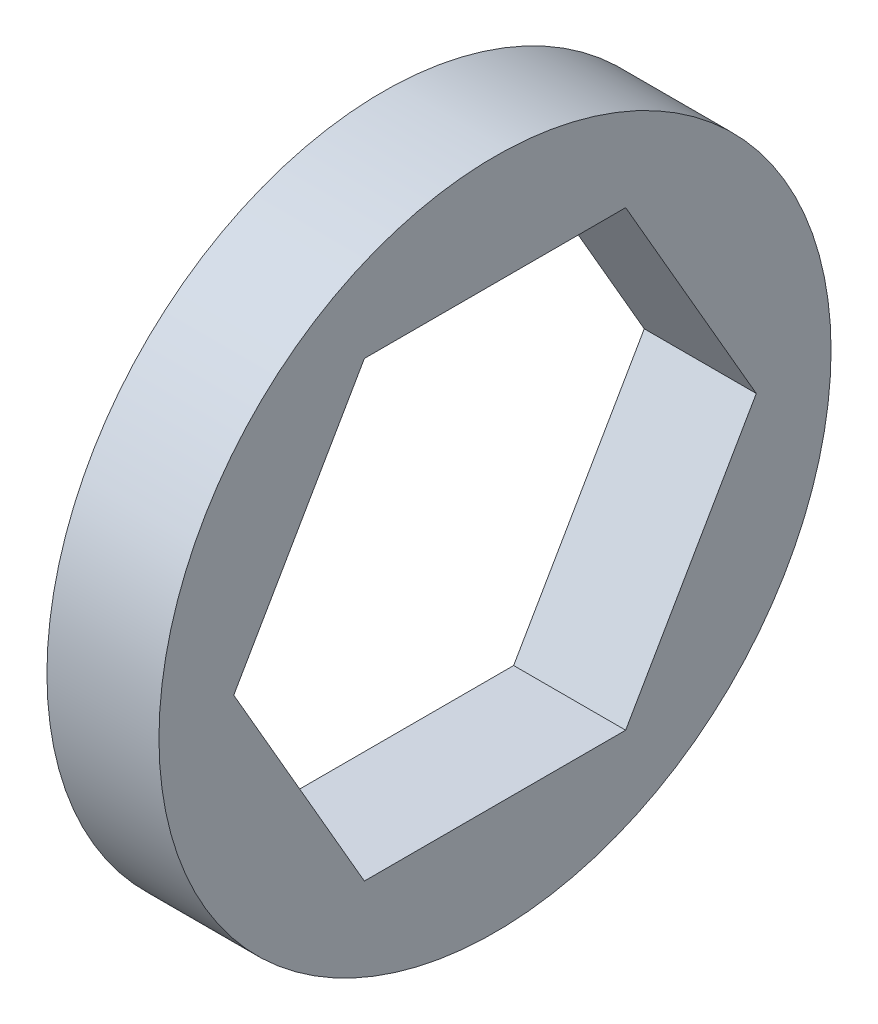
ISO-10303-21;
HEADER;
FILE_DESCRIPTION(('STEP AP214'),'2;1');
FILE_NAME('part.step','',(''),(''),'','','');
FILE_SCHEMA(('AUTOMOTIVE_DESIGN { 1 0 10303 214 1 1 1 1 }'));
ENDSEC;
DATA;
#1=APPLICATION_CONTEXT('core data for automotive mechanical design processes');
#2=APPLICATION_PROTOCOL_DEFINITION('international standard','automotive_design',2000,#1);
#3=PRODUCT_CONTEXT('',#1,'mechanical');
#4=PRODUCT('Part','Part','',(#3));
#5=PRODUCT_RELATED_PRODUCT_CATEGORY('part','',(#4));
#6=PRODUCT_DEFINITION_FORMATION('','',#4);
#7=PRODUCT_DEFINITION_CONTEXT('part definition',#1,'design');
#8=PRODUCT_DEFINITION('design','',#6,#7);
#9=PRODUCT_DEFINITION_SHAPE('','',#8);
#10=(LENGTH_UNIT() NAMED_UNIT(*) SI_UNIT(.MILLI.,.METRE.));
#11=(NAMED_UNIT(*) PLANE_ANGLE_UNIT() SI_UNIT($,.RADIAN.));
#12=(NAMED_UNIT(*) SI_UNIT($,.STERADIAN.) SOLID_ANGLE_UNIT());
#13=UNCERTAINTY_MEASURE_WITH_UNIT(LENGTH_MEASURE(1.E-05),#10,'distance_accuracy_value','');
#14=(GEOMETRIC_REPRESENTATION_CONTEXT(3) GLOBAL_UNCERTAINTY_ASSIGNED_CONTEXT((#13)) GLOBAL_UNIT_ASSIGNED_CONTEXT((#10,
#11,#12)) REPRESENTATION_CONTEXT('',''));
#15=CARTESIAN_POINT('',(0.,0.,0.));
#16=DIRECTION('',(0.,0.,1.));
#17=DIRECTION('',(1.,0.,0.));
#18=AXIS2_PLACEMENT_3D('',#15,#16,#17);
#19=CARTESIAN_POINT('',(3.175,0.,0.));
#20=DIRECTION('',(1.,0.,0.));
#21=DIRECTION('',(0.,0.,-1.));
#22=AXIS2_PLACEMENT_3D('',#19,#20,#21);
#23=PLANE('',#22);
#24=CARTESIAN_POINT('',(3.175,0.,0.));
#25=DIRECTION('',(1.,0.,0.));
#26=DIRECTION('',(0.,0.,-1.));
#27=AXIS2_PLACEMENT_3D('',#24,#25,#26);
#28=CIRCLE('',#27,9.525);
#29=CARTESIAN_POINT('',(3.175,0.,-9.525));
#30=VERTEX_POINT('',#29);
#31=EDGE_CURVE('E11',#30,#30,#28,.T.);
#32=ORIENTED_EDGE('',*,*,#31,.T.);
#33=EDGE_LOOP('',(#32));
#34=FACE_BOUND('',#33,.T.);
#35=DIRECTION('',(0.,0.,1.));
#36=VECTOR('',#35,1.);
#37=CARTESIAN_POINT('',(3.175,6.4135,-3.70283595144766));
#38=LINE('',#37,#36);
#39=CARTESIAN_POINT('',(3.175,6.4135,-3.70283595144766));
#40=VERTEX_POINT('',#39);
#41=CARTESIAN_POINT('',(3.175,6.4135,3.70283595144767));
#42=VERTEX_POINT('',#41);
#43=EDGE_CURVE('E102',#40,#42,#38,.T.);
#44=ORIENTED_EDGE('',*,*,#43,.F.);
#45=DIRECTION('',(0.,0.866025403784438,0.5));
#46=VECTOR('',#45,1.);
#47=CARTESIAN_POINT('',(3.175,0.,-7.40567190289533));
#48=LINE('',#47,#46);
#49=CARTESIAN_POINT('',(3.175,0.,-7.40567190289533));
#50=VERTEX_POINT('',#49);
#51=EDGE_CURVE('E94',#50,#40,#48,.T.);
#52=ORIENTED_EDGE('',*,*,#51,.F.);
#53=DIRECTION('',(0.,0.866025403784439,-0.5));
#54=VECTOR('',#53,1.);
#55=CARTESIAN_POINT('',(3.175,-6.4135,-3.70283595144767));
#56=LINE('',#55,#54);
#57=CARTESIAN_POINT('',(3.175,-6.4135,-3.70283595144767));
#58=VERTEX_POINT('',#57);
#59=EDGE_CURVE('E122',#58,#50,#56,.T.);
#60=ORIENTED_EDGE('',*,*,#59,.F.);
#61=DIRECTION('',(0.,0.,-1.));
#62=VECTOR('',#61,1.);
#63=CARTESIAN_POINT('',(3.175,-6.4135,3.70283595144766));
#64=LINE('',#63,#62);
#65=CARTESIAN_POINT('',(3.175,-6.4135,3.70283595144766));
#66=VERTEX_POINT('',#65);
#67=EDGE_CURVE('E120',#66,#58,#64,.T.);
#68=ORIENTED_EDGE('',*,*,#67,.F.);
#69=DIRECTION('',(0.,-0.866025403784438,-0.5));
#70=VECTOR('',#69,1.);
#71=CARTESIAN_POINT('',(3.175,0.,7.40567190289533));
#72=LINE('',#71,#70);
#73=CARTESIAN_POINT('',(3.175,0.,7.40567190289533));
#74=VERTEX_POINT('',#73);
#75=EDGE_CURVE('E116',#74,#66,#72,.T.);
#76=ORIENTED_EDGE('',*,*,#75,.F.);
#77=DIRECTION('',(0.,-0.866025403784439,0.5));
#78=VECTOR('',#77,1.);
#79=CARTESIAN_POINT('',(3.175,6.4135,3.70283595144767));
#80=LINE('',#79,#78);
#81=EDGE_CURVE('E114',#42,#74,#80,.T.);
#82=ORIENTED_EDGE('',*,*,#81,.F.);
#83=EDGE_LOOP('',(#44,#52,#60,#68,#76,#82));
#84=FACE_BOUND('',#83,.T.);
#85=ADVANCED_FACE('F41',(#34,#84),#23,.T.);
#86=CARTESIAN_POINT('',(0.,0.,0.));
#87=DIRECTION('',(1.,0.,0.));
#88=DIRECTION('',(0.,0.,-1.));
#89=AXIS2_PLACEMENT_3D('',#86,#87,#88);
#90=PLANE('',#89);
#91=CARTESIAN_POINT('',(0.,0.,0.));
#92=DIRECTION('',(1.,0.,0.));
#93=DIRECTION('',(0.,0.,-1.));
#94=AXIS2_PLACEMENT_3D('',#91,#92,#93);
#95=CIRCLE('',#94,9.525);
#96=CARTESIAN_POINT('',(0.,0.,-9.525));
#97=VERTEX_POINT('',#96);
#98=EDGE_CURVE('E45',#97,#97,#95,.T.);
#99=ORIENTED_EDGE('',*,*,#98,.F.);
#100=EDGE_LOOP('',(#99));
#101=FACE_BOUND('',#100,.T.);
#102=DIRECTION('',(0.,0.866025403784438,0.5));
#103=VECTOR('',#102,1.);
#104=CARTESIAN_POINT('',(0.,0.,-7.40567190289533));
#105=LINE('',#104,#103);
#106=CARTESIAN_POINT('',(0.,0.,-7.40567190289533));
#107=VERTEX_POINT('',#106);
#108=CARTESIAN_POINT('',(0.,6.4135,-3.70283595144766));
#109=VERTEX_POINT('',#108);
#110=EDGE_CURVE('E64',#107,#109,#105,.T.);
#111=ORIENTED_EDGE('',*,*,#110,.T.);
#112=DIRECTION('',(0.,0.,1.));
#113=VECTOR('',#112,1.);
#114=CARTESIAN_POINT('',(0.,6.4135,-3.70283595144766));
#115=LINE('',#114,#113);
#116=CARTESIAN_POINT('',(0.,6.4135,3.70283595144767));
#117=VERTEX_POINT('',#116);
#118=EDGE_CURVE('E109',#109,#117,#115,.T.);
#119=ORIENTED_EDGE('',*,*,#118,.T.);
#120=DIRECTION('',(0.,-0.866025403784439,0.5));
#121=VECTOR('',#120,1.);
#122=CARTESIAN_POINT('',(0.,6.4135,3.70283595144767));
#123=LINE('',#122,#121);
#124=CARTESIAN_POINT('',(0.,0.,7.40567190289533));
#125=VERTEX_POINT('',#124);
#126=EDGE_CURVE('E126',#117,#125,#123,.T.);
#127=ORIENTED_EDGE('',*,*,#126,.T.);
#128=DIRECTION('',(0.,-0.866025403784438,-0.5));
#129=VECTOR('',#128,1.);
#130=CARTESIAN_POINT('',(0.,0.,7.40567190289533));
#131=LINE('',#130,#129);
#132=CARTESIAN_POINT('',(0.,-6.4135,3.70283595144766));
#133=VERTEX_POINT('',#132);
#134=EDGE_CURVE('E129',#125,#133,#131,.T.);
#135=ORIENTED_EDGE('',*,*,#134,.T.);
#136=DIRECTION('',(0.,0.,-1.));
#137=VECTOR('',#136,1.);
#138=CARTESIAN_POINT('',(0.,-6.4135,3.70283595144766));
#139=LINE('',#138,#137);
#140=CARTESIAN_POINT('',(0.,-6.4135,-3.70283595144767));
#141=VERTEX_POINT('',#140);
#142=EDGE_CURVE('E132',#133,#141,#139,.T.);
#143=ORIENTED_EDGE('',*,*,#142,.T.);
#144=DIRECTION('',(0.,0.866025403784439,-0.5));
#145=VECTOR('',#144,1.);
#146=CARTESIAN_POINT('',(0.,-6.4135,-3.70283595144767));
#147=LINE('',#146,#145);
#148=EDGE_CURVE('E103',#141,#107,#147,.T.);
#149=ORIENTED_EDGE('',*,*,#148,.T.);
#150=EDGE_LOOP('',(#111,#119,#127,#135,#143,#149));
#151=FACE_BOUND('',#150,.T.);
#152=ADVANCED_FACE('F149',(#101,#151),#90,.F.);
#153=CARTESIAN_POINT('',(3.175,0.,0.));
#154=DIRECTION('',(-1.,0.,0.));
#155=DIRECTION('',(0.,0.,1.));
#156=AXIS2_PLACEMENT_3D('',#153,#154,#155);
#157=CYLINDRICAL_SURFACE('',#156,9.525);
#158=ORIENTED_EDGE('',*,*,#31,.F.);
#159=EDGE_LOOP('',(#158));
#160=FACE_BOUND('',#159,.T.);
#161=ORIENTED_EDGE('',*,*,#98,.T.);
#162=EDGE_LOOP('',(#161));
#163=FACE_BOUND('',#162,.T.);
#164=ADVANCED_FACE('F43',(#160,#163),#157,.T.);
#165=CARTESIAN_POINT('',(3.175,0.,-7.40567190289533));
#166=DIRECTION('',(0.,-0.5,0.866025403784438));
#167=DIRECTION('',(0.,-0.866025403784438,-0.5));
#168=AXIS2_PLACEMENT_3D('',#165,#166,#167);
#169=PLANE('',#168);
#170=ORIENTED_EDGE('',*,*,#110,.F.);
#171=DIRECTION('',(-1.,0.,0.));
#172=VECTOR('',#171,1.);
#173=CARTESIAN_POINT('',(3.175,0.,-7.40567190289533));
#174=LINE('',#173,#172);
#175=EDGE_CURVE('E98',#50,#107,#174,.T.);
#176=ORIENTED_EDGE('',*,*,#175,.F.);
#177=ORIENTED_EDGE('',*,*,#51,.T.);
#178=DIRECTION('',(-1.,0.,0.));
#179=VECTOR('',#178,1.);
#180=CARTESIAN_POINT('',(3.175,6.4135,-3.70283595144766));
#181=LINE('',#180,#179);
#182=EDGE_CURVE('E97',#40,#109,#181,.T.);
#183=ORIENTED_EDGE('',*,*,#182,.T.);
#184=EDGE_LOOP('',(#170,#176,#177,#183));
#185=FACE_BOUND('',#184,.T.);
#186=ADVANCED_FACE('F96',(#185),#169,.T.);
#187=CARTESIAN_POINT('',(3.175,6.4135,-3.70283595144766));
#188=DIRECTION('',(0.,-1.,0.));
#189=DIRECTION('',(0.,0.,-1.));
#190=AXIS2_PLACEMENT_3D('',#187,#188,#189);
#191=PLANE('',#190);
#192=ORIENTED_EDGE('',*,*,#118,.F.);
#193=ORIENTED_EDGE('',*,*,#182,.F.);
#194=ORIENTED_EDGE('',*,*,#43,.T.);
#195=DIRECTION('',(-1.,0.,0.));
#196=VECTOR('',#195,1.);
#197=CARTESIAN_POINT('',(3.175,6.4135,3.70283595144767));
#198=LINE('',#197,#196);
#199=EDGE_CURVE('E110',#42,#117,#198,.T.);
#200=ORIENTED_EDGE('',*,*,#199,.T.);
#201=EDGE_LOOP('',(#192,#193,#194,#200));
#202=FACE_BOUND('',#201,.T.);
#203=ADVANCED_FACE('F106',(#202),#191,.T.);
#204=CARTESIAN_POINT('',(3.175,6.4135,3.70283595144767));
#205=DIRECTION('',(0.,-0.5,-0.866025403784439));
#206=DIRECTION('',(0.,0.866025403784439,-0.5));
#207=AXIS2_PLACEMENT_3D('',#204,#205,#206);
#208=PLANE('',#207);
#209=ORIENTED_EDGE('',*,*,#126,.F.);
#210=ORIENTED_EDGE('',*,*,#199,.F.);
#211=ORIENTED_EDGE('',*,*,#81,.T.);
#212=DIRECTION('',(-1.,0.,0.));
#213=VECTOR('',#212,1.);
#214=CARTESIAN_POINT('',(3.175,0.,7.40567190289533));
#215=LINE('',#214,#213);
#216=EDGE_CURVE('E141',#74,#125,#215,.T.);
#217=ORIENTED_EDGE('',*,*,#216,.T.);
#218=EDGE_LOOP('',(#209,#210,#211,#217));
#219=FACE_BOUND('',#218,.T.);
#220=ADVANCED_FACE('F145',(#219),#208,.T.);
#221=CARTESIAN_POINT('',(3.175,0.,7.40567190289533));
#222=DIRECTION('',(0.,0.5,-0.866025403784438));
#223=DIRECTION('',(0.,0.866025403784438,0.5));
#224=AXIS2_PLACEMENT_3D('',#221,#222,#223);
#225=PLANE('',#224);
#226=ORIENTED_EDGE('',*,*,#134,.F.);
#227=ORIENTED_EDGE('',*,*,#216,.F.);
#228=ORIENTED_EDGE('',*,*,#75,.T.);
#229=DIRECTION('',(-1.,0.,0.));
#230=VECTOR('',#229,1.);
#231=CARTESIAN_POINT('',(3.175,-6.4135,3.70283595144766));
#232=LINE('',#231,#230);
#233=EDGE_CURVE('E139',#66,#133,#232,.T.);
#234=ORIENTED_EDGE('',*,*,#233,.T.);
#235=EDGE_LOOP('',(#226,#227,#228,#234));
#236=FACE_BOUND('',#235,.T.);
#237=ADVANCED_FACE('F157',(#236),#225,.T.);
#238=CARTESIAN_POINT('',(3.175,-6.4135,3.70283595144766));
#239=DIRECTION('',(0.,1.,0.));
#240=DIRECTION('',(0.,0.,1.));
#241=AXIS2_PLACEMENT_3D('',#238,#239,#240);
#242=PLANE('',#241);
#243=ORIENTED_EDGE('',*,*,#142,.F.);
#244=ORIENTED_EDGE('',*,*,#233,.F.);
#245=ORIENTED_EDGE('',*,*,#67,.T.);
#246=DIRECTION('',(-1.,0.,0.));
#247=VECTOR('',#246,1.);
#248=CARTESIAN_POINT('',(3.175,-6.4135,-3.70283595144767));
#249=LINE('',#248,#247);
#250=EDGE_CURVE('E56',#58,#141,#249,.T.);
#251=ORIENTED_EDGE('',*,*,#250,.T.);
#252=EDGE_LOOP('',(#243,#244,#245,#251));
#253=FACE_BOUND('',#252,.T.);
#254=ADVANCED_FACE('F155',(#253),#242,.T.);
#255=CARTESIAN_POINT('',(3.175,-6.4135,-3.70283595144767));
#256=DIRECTION('',(0.,0.5,0.866025403784439));
#257=DIRECTION('',(0.,-0.866025403784439,0.5));
#258=AXIS2_PLACEMENT_3D('',#255,#256,#257);
#259=PLANE('',#258);
#260=ORIENTED_EDGE('',*,*,#148,.F.);
#261=ORIENTED_EDGE('',*,*,#250,.F.);
#262=ORIENTED_EDGE('',*,*,#59,.T.);
#263=ORIENTED_EDGE('',*,*,#175,.T.);
#264=EDGE_LOOP('',(#260,#261,#262,#263));
#265=FACE_BOUND('',#264,.T.);
#266=ADVANCED_FACE('F151',(#265),#259,.T.);
#267=CLOSED_SHELL('',(#85,#152,#164,#186,#203,#220,#237,#254,#266));
#268=MANIFOLD_SOLID_BREP('B2',#267);
#269=ADVANCED_BREP_SHAPE_REPRESENTATION('',(#18,#268),#14);
#270=SHAPE_DEFINITION_REPRESENTATION(#9,#269);
ENDSEC;
END-ISO-10303-21;
